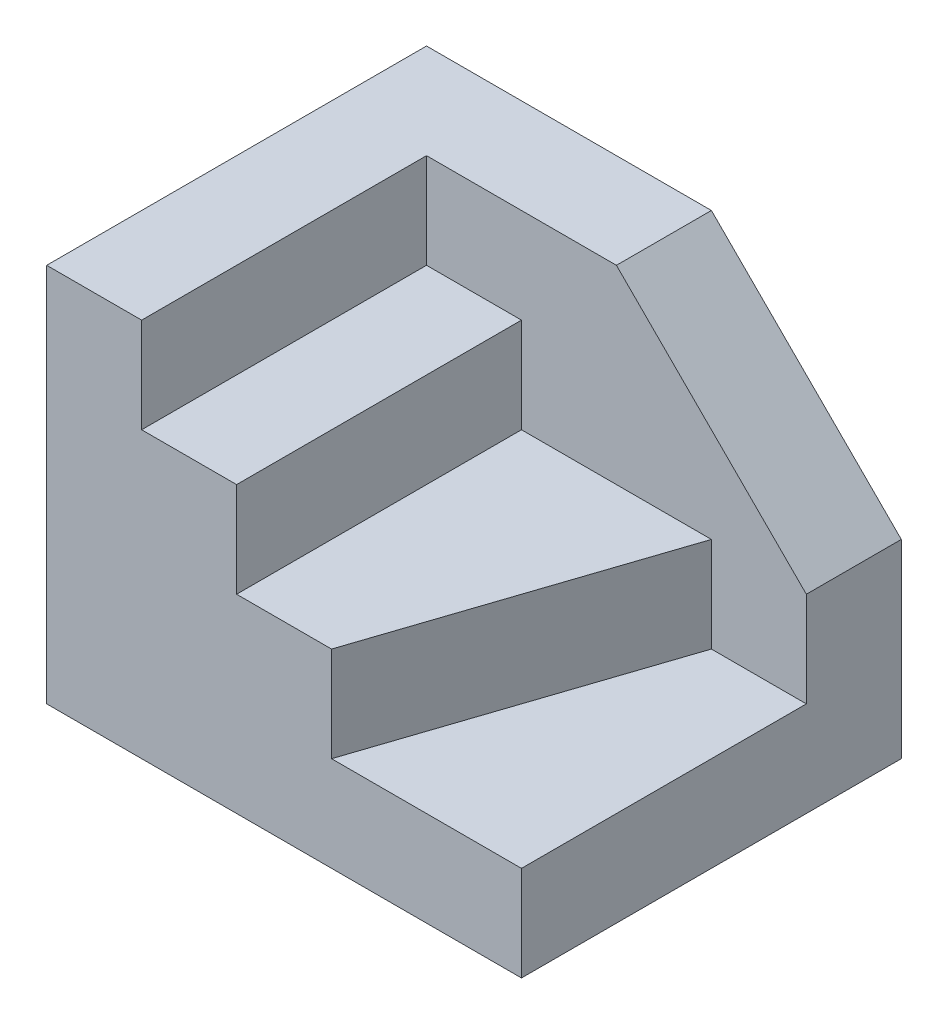
ISO-10303-21;
HEADER;
FILE_DESCRIPTION(('STEP AP214'),'2;1');
FILE_NAME('part.step','',(''),(''),'','','');
FILE_SCHEMA(('AUTOMOTIVE_DESIGN { 1 0 10303 214 1 1 1 1 }'));
ENDSEC;
DATA;
#1=APPLICATION_CONTEXT('core data for automotive mechanical design processes');
#2=APPLICATION_PROTOCOL_DEFINITION('international standard','automotive_design',2000,#1);
#3=PRODUCT_CONTEXT('',#1,'mechanical');
#4=PRODUCT('Part','Part','',(#3));
#5=PRODUCT_RELATED_PRODUCT_CATEGORY('part','',(#4));
#6=PRODUCT_DEFINITION_FORMATION('','',#4);
#7=PRODUCT_DEFINITION_CONTEXT('part definition',#1,'design');
#8=PRODUCT_DEFINITION('design','',#6,#7);
#9=PRODUCT_DEFINITION_SHAPE('','',#8);
#10=(LENGTH_UNIT() NAMED_UNIT(*) SI_UNIT(.MILLI.,.METRE.));
#11=(NAMED_UNIT(*) PLANE_ANGLE_UNIT() SI_UNIT($,.RADIAN.));
#12=(NAMED_UNIT(*) SI_UNIT($,.STERADIAN.) SOLID_ANGLE_UNIT());
#13=UNCERTAINTY_MEASURE_WITH_UNIT(LENGTH_MEASURE(1.E-05),#10,'distance_accuracy_value','');
#14=(GEOMETRIC_REPRESENTATION_CONTEXT(3) GLOBAL_UNCERTAINTY_ASSIGNED_CONTEXT((#13)) GLOBAL_UNIT_ASSIGNED_CONTEXT((#10,
#11,#12)) REPRESENTATION_CONTEXT('',''));
#15=CARTESIAN_POINT('',(0.,0.,0.));
#16=DIRECTION('',(0.,0.,1.));
#17=DIRECTION('',(1.,0.,0.));
#18=AXIS2_PLACEMENT_3D('',#15,#16,#17);
#19=CARTESIAN_POINT('',(5.,10.,-10.));
#20=DIRECTION('',(0.,-1.,0.));
#21=DIRECTION('',(1.,0.,0.));
#22=AXIS2_PLACEMENT_3D('',#19,#20,#21);
#23=PLANE('',#22);
#24=DIRECTION('',(0.316227766016838,0.,-0.948683298050514));
#25=VECTOR('',#24,1.);
#26=CARTESIAN_POINT('',(5.,10.,20.));
#27=LINE('',#26,#25);
#28=CARTESIAN_POINT('',(5.,10.,20.));
#29=VERTEX_POINT('',#28);
#30=CARTESIAN_POINT('',(15.,9.99999999999999,-10.));
#31=VERTEX_POINT('',#30);
#32=EDGE_CURVE('E128',#29,#31,#27,.T.);
#33=ORIENTED_EDGE('',*,*,#32,.F.);
#34=DIRECTION('',(1.,0.,0.));
#35=VECTOR('',#34,1.);
#36=CARTESIAN_POINT('',(5.,10.,20.));
#37=LINE('',#36,#35);
#38=CARTESIAN_POINT('',(25.,9.99999999999999,20.));
#39=VERTEX_POINT('',#38);
#40=EDGE_CURVE('E193',#29,#39,#37,.T.);
#41=ORIENTED_EDGE('',*,*,#40,.T.);
#42=DIRECTION('',(0.,0.,1.));
#43=VECTOR('',#42,1.);
#44=CARTESIAN_POINT('',(25.,9.99999999999999,-10.));
#45=LINE('',#44,#43);
#46=CARTESIAN_POINT('',(25.,9.99999999999999,-10.));
#47=VERTEX_POINT('',#46);
#48=EDGE_CURVE('E148',#47,#39,#45,.T.);
#49=ORIENTED_EDGE('',*,*,#48,.F.);
#50=DIRECTION('',(1.,0.,0.));
#51=VECTOR('',#50,1.);
#52=CARTESIAN_POINT('',(5.,10.,-10.));
#53=LINE('',#52,#51);
#54=EDGE_CURVE('E210',#31,#47,#53,.T.);
#55=ORIENTED_EDGE('',*,*,#54,.F.);
#56=EDGE_LOOP('',(#33,#41,#49,#55));
#57=FACE_BOUND('',#56,.T.);
#58=ADVANCED_FACE('F32',(#57),#23,.F.);
#59=CARTESIAN_POINT('',(0.,0.,-10.));
#60=DIRECTION('',(0.,0.,1.));
#61=DIRECTION('',(1.,0.,0.));
#62=AXIS2_PLACEMENT_3D('',#59,#60,#61);
#63=PLANE('',#62);
#64=DIRECTION('',(0.707106781186548,-0.707106781186548,0.));
#65=VECTOR('',#64,1.);
#66=CARTESIAN_POINT('',(5.,40.,-10.));
#67=LINE('',#66,#65);
#68=CARTESIAN_POINT('',(5.,40.,-10.));
#69=VERTEX_POINT('',#68);
#70=CARTESIAN_POINT('',(25.,20.,-10.));
#71=VERTEX_POINT('',#70);
#72=EDGE_CURVE('E123',#69,#71,#67,.T.);
#73=ORIENTED_EDGE('',*,*,#72,.F.);
#74=DIRECTION('',(-1.,0.,0.));
#75=VECTOR('',#74,1.);
#76=CARTESIAN_POINT('',(25.,40.,-10.));
#77=LINE('',#76,#75);
#78=CARTESIAN_POINT('',(-15.,40.,-10.));
#79=VERTEX_POINT('',#78);
#80=EDGE_CURVE('E195',#69,#79,#77,.T.);
#81=ORIENTED_EDGE('',*,*,#80,.T.);
#82=DIRECTION('',(0.,-1.,0.));
#83=VECTOR('',#82,1.);
#84=CARTESIAN_POINT('',(-15.,40.,-10.));
#85=LINE('',#84,#83);
#86=CARTESIAN_POINT('',(-15.,30.,-10.));
#87=VERTEX_POINT('',#86);
#88=EDGE_CURVE('E218',#79,#87,#85,.T.);
#89=ORIENTED_EDGE('',*,*,#88,.T.);
#90=DIRECTION('',(1.,0.,0.));
#91=VECTOR('',#90,1.);
#92=CARTESIAN_POINT('',(-15.,30.,-10.));
#93=LINE('',#92,#91);
#94=CARTESIAN_POINT('',(-5.,30.,-10.));
#95=VERTEX_POINT('',#94);
#96=EDGE_CURVE('E215',#87,#95,#93,.T.);
#97=ORIENTED_EDGE('',*,*,#96,.T.);
#98=DIRECTION('',(0.,-1.,0.));
#99=VECTOR('',#98,1.);
#100=CARTESIAN_POINT('',(-5.,30.,-10.));
#101=LINE('',#100,#99);
#102=CARTESIAN_POINT('',(-4.99999999999999,20.,-10.));
#103=VERTEX_POINT('',#102);
#104=EDGE_CURVE('E213',#95,#103,#101,.T.);
#105=ORIENTED_EDGE('',*,*,#104,.T.);
#106=DIRECTION('',(1.,0.,0.));
#107=VECTOR('',#106,1.);
#108=CARTESIAN_POINT('',(-4.99999999999999,20.,-10.));
#109=LINE('',#108,#107);
#110=CARTESIAN_POINT('',(15.,20.,-10.));
#111=VERTEX_POINT('',#110);
#112=EDGE_CURVE('E55',#103,#111,#109,.T.);
#113=ORIENTED_EDGE('',*,*,#112,.T.);
#114=DIRECTION('',(0.,-1.,0.));
#115=VECTOR('',#114,1.);
#116=CARTESIAN_POINT('',(15.,20.,-10.));
#117=LINE('',#116,#115);
#118=EDGE_CURVE('E208',#111,#31,#117,.T.);
#119=ORIENTED_EDGE('',*,*,#118,.T.);
#120=ORIENTED_EDGE('',*,*,#54,.T.);
#121=DIRECTION('',(0.,1.,0.));
#122=VECTOR('',#121,1.);
#123=CARTESIAN_POINT('',(25.,9.99999999999999,-10.));
#124=LINE('',#123,#122);
#125=EDGE_CURVE('E188',#47,#71,#124,.T.);
#126=ORIENTED_EDGE('',*,*,#125,.T.);
#127=EDGE_LOOP('',(#73,#81,#89,#97,#105,#113,#119,#120,#126));
#128=FACE_BOUND('',#127,.T.);
#129=ADVANCED_FACE('F229',(#128),#63,.T.);
#130=CARTESIAN_POINT('',(25.,40.,20.));
#131=DIRECTION('',(-1.,0.,0.));
#132=DIRECTION('',(0.,0.,1.));
#133=AXIS2_PLACEMENT_3D('',#130,#131,#132);
#134=PLANE('',#133);
#135=DIRECTION('',(0.,-1.,0.));
#136=VECTOR('',#135,1.);
#137=CARTESIAN_POINT('',(25.,40.,-20.));
#138=LINE('',#137,#136);
#139=CARTESIAN_POINT('',(25.,20.,-20.));
#140=VERTEX_POINT('',#139);
#141=CARTESIAN_POINT('',(25.,0.,-20.));
#142=VERTEX_POINT('',#141);
#143=EDGE_CURVE('E11',#140,#142,#138,.T.);
#144=ORIENTED_EDGE('',*,*,#143,.F.);
#145=DIRECTION('',(0.,0.,1.));
#146=VECTOR('',#145,1.);
#147=CARTESIAN_POINT('',(25.,20.,-20.));
#148=LINE('',#147,#146);
#149=EDGE_CURVE('E120',#140,#71,#148,.T.);
#150=ORIENTED_EDGE('',*,*,#149,.T.);
#151=ORIENTED_EDGE('',*,*,#125,.F.);
#152=ORIENTED_EDGE('',*,*,#48,.T.);
#153=DIRECTION('',(0.,-1.,0.));
#154=VECTOR('',#153,1.);
#155=CARTESIAN_POINT('',(25.,40.,20.));
#156=LINE('',#155,#154);
#157=CARTESIAN_POINT('',(25.,0.,20.));
#158=VERTEX_POINT('',#157);
#159=EDGE_CURVE('E143',#39,#158,#156,.T.);
#160=ORIENTED_EDGE('',*,*,#159,.T.);
#161=DIRECTION('',(0.,0.,-1.));
#162=VECTOR('',#161,1.);
#163=CARTESIAN_POINT('',(25.,0.,20.));
#164=LINE('',#163,#162);
#165=EDGE_CURVE('E140',#158,#142,#164,.T.);
#166=ORIENTED_EDGE('',*,*,#165,.T.);
#167=EDGE_LOOP('',(#144,#150,#151,#152,#160,#166));
#168=FACE_BOUND('',#167,.T.);
#169=ADVANCED_FACE('F34',(#168),#134,.F.);
#170=CARTESIAN_POINT('',(-25.,40.,-20.));
#171=DIRECTION('',(0.,0.,1.));
#172=DIRECTION('',(1.,0.,0.));
#173=AXIS2_PLACEMENT_3D('',#170,#171,#172);
#174=PLANE('',#173);
#175=DIRECTION('',(-1.,0.,0.));
#176=VECTOR('',#175,1.);
#177=CARTESIAN_POINT('',(-25.,40.,-20.));
#178=LINE('',#177,#176);
#179=CARTESIAN_POINT('',(4.99999999999999,40.,-20.));
#180=VERTEX_POINT('',#179);
#181=CARTESIAN_POINT('',(-25.,40.,-20.));
#182=VERTEX_POINT('',#181);
#183=EDGE_CURVE('E136',#180,#182,#178,.T.);
#184=ORIENTED_EDGE('',*,*,#183,.F.);
#185=DIRECTION('',(0.707106781186548,-0.707106781186548,0.));
#186=VECTOR('',#185,1.);
#187=CARTESIAN_POINT('',(5.,40.,-20.));
#188=LINE('',#187,#186);
#189=EDGE_CURVE('E47',#180,#140,#188,.T.);
#190=ORIENTED_EDGE('',*,*,#189,.T.);
#191=ORIENTED_EDGE('',*,*,#143,.T.);
#192=DIRECTION('',(-1.,0.,0.));
#193=VECTOR('',#192,1.);
#194=CARTESIAN_POINT('',(-25.,0.,-20.));
#195=LINE('',#194,#193);
#196=CARTESIAN_POINT('',(-25.,0.,-20.));
#197=VERTEX_POINT('',#196);
#198=EDGE_CURVE('E147',#142,#197,#195,.T.);
#199=ORIENTED_EDGE('',*,*,#198,.T.);
#200=DIRECTION('',(0.,-1.,0.));
#201=VECTOR('',#200,1.);
#202=CARTESIAN_POINT('',(-25.,40.,-20.));
#203=LINE('',#202,#201);
#204=EDGE_CURVE('E40',#182,#197,#203,.T.);
#205=ORIENTED_EDGE('',*,*,#204,.F.);
#206=EDGE_LOOP('',(#184,#190,#191,#199,#205));
#207=FACE_BOUND('',#206,.T.);
#208=ADVANCED_FACE('F133',(#207),#174,.F.);
#209=CARTESIAN_POINT('',(-25.,40.,20.));
#210=DIRECTION('',(1.,0.,0.));
#211=DIRECTION('',(0.,0.,-1.));
#212=AXIS2_PLACEMENT_3D('',#209,#210,#211);
#213=PLANE('',#212);
#214=DIRECTION('',(0.,0.,1.));
#215=VECTOR('',#214,1.);
#216=CARTESIAN_POINT('',(-25.,0.,20.));
#217=LINE('',#216,#215);
#218=CARTESIAN_POINT('',(-25.,0.,20.));
#219=VERTEX_POINT('',#218);
#220=EDGE_CURVE('E150',#197,#219,#217,.T.);
#221=ORIENTED_EDGE('',*,*,#220,.T.);
#222=DIRECTION('',(0.,-1.,0.));
#223=VECTOR('',#222,1.);
#224=CARTESIAN_POINT('',(-25.,40.,20.));
#225=LINE('',#224,#223);
#226=CARTESIAN_POINT('',(-25.,40.,20.));
#227=VERTEX_POINT('',#226);
#228=EDGE_CURVE('E162',#227,#219,#225,.T.);
#229=ORIENTED_EDGE('',*,*,#228,.F.);
#230=DIRECTION('',(0.,0.,1.));
#231=VECTOR('',#230,1.);
#232=CARTESIAN_POINT('',(-25.,40.,20.));
#233=LINE('',#232,#231);
#234=EDGE_CURVE('E170',#182,#227,#233,.T.);
#235=ORIENTED_EDGE('',*,*,#234,.F.);
#236=ORIENTED_EDGE('',*,*,#204,.T.);
#237=EDGE_LOOP('',(#221,#229,#235,#236));
#238=FACE_BOUND('',#237,.T.);
#239=ADVANCED_FACE('F168',(#238),#213,.F.);
#240=CARTESIAN_POINT('',(-25.,40.,20.));
#241=DIRECTION('',(0.,0.,-1.));
#242=DIRECTION('',(-1.,0.,0.));
#243=AXIS2_PLACEMENT_3D('',#240,#241,#242);
#244=PLANE('',#243);
#245=ORIENTED_EDGE('',*,*,#159,.F.);
#246=ORIENTED_EDGE('',*,*,#40,.F.);
#247=DIRECTION('',(0.,-1.,0.));
#248=VECTOR('',#247,1.);
#249=CARTESIAN_POINT('',(5.,20.,20.));
#250=LINE('',#249,#248);
#251=CARTESIAN_POINT('',(5.,20.,20.));
#252=VERTEX_POINT('',#251);
#253=EDGE_CURVE('E196',#252,#29,#250,.T.);
#254=ORIENTED_EDGE('',*,*,#253,.F.);
#255=DIRECTION('',(1.,0.,0.));
#256=VECTOR('',#255,1.);
#257=CARTESIAN_POINT('',(-4.99999999999999,20.,20.));
#258=LINE('',#257,#256);
#259=CARTESIAN_POINT('',(-4.99999999999999,20.,20.));
#260=VERTEX_POINT('',#259);
#261=EDGE_CURVE('E198',#260,#252,#258,.T.);
#262=ORIENTED_EDGE('',*,*,#261,.F.);
#263=DIRECTION('',(0.,-1.,0.));
#264=VECTOR('',#263,1.);
#265=CARTESIAN_POINT('',(-5.,30.,20.));
#266=LINE('',#265,#264);
#267=CARTESIAN_POINT('',(-5.,30.,20.));
#268=VERTEX_POINT('',#267);
#269=EDGE_CURVE('E201',#268,#260,#266,.T.);
#270=ORIENTED_EDGE('',*,*,#269,.F.);
#271=DIRECTION('',(1.,0.,0.));
#272=VECTOR('',#271,1.);
#273=CARTESIAN_POINT('',(-15.,30.,20.));
#274=LINE('',#273,#272);
#275=CARTESIAN_POINT('',(-15.,30.,20.));
#276=VERTEX_POINT('',#275);
#277=EDGE_CURVE('E204',#276,#268,#274,.T.);
#278=ORIENTED_EDGE('',*,*,#277,.F.);
#279=DIRECTION('',(0.,-1.,0.));
#280=VECTOR('',#279,1.);
#281=CARTESIAN_POINT('',(-15.,40.,20.));
#282=LINE('',#281,#280);
#283=CARTESIAN_POINT('',(-15.,40.,20.));
#284=VERTEX_POINT('',#283);
#285=EDGE_CURVE('E180',#284,#276,#282,.T.);
#286=ORIENTED_EDGE('',*,*,#285,.F.);
#287=DIRECTION('',(1.,0.,0.));
#288=VECTOR('',#287,1.);
#289=CARTESIAN_POINT('',(-25.,40.,20.));
#290=LINE('',#289,#288);
#291=EDGE_CURVE('E155',#227,#284,#290,.T.);
#292=ORIENTED_EDGE('',*,*,#291,.F.);
#293=ORIENTED_EDGE('',*,*,#228,.T.);
#294=DIRECTION('',(1.,0.,0.));
#295=VECTOR('',#294,1.);
#296=CARTESIAN_POINT('',(-25.,0.,20.));
#297=LINE('',#296,#295);
#298=EDGE_CURVE('E159',#219,#158,#297,.T.);
#299=ORIENTED_EDGE('',*,*,#298,.T.);
#300=EDGE_LOOP('',(#245,#246,#254,#262,#270,#278,#286,#292,#293,#299));
#301=FACE_BOUND('',#300,.T.);
#302=ADVANCED_FACE('F173',(#301),#244,.F.);
#303=CARTESIAN_POINT('',(0.,40.,0.));
#304=DIRECTION('',(0.,-1.,0.));
#305=DIRECTION('',(0.,0.,-1.));
#306=AXIS2_PLACEMENT_3D('',#303,#304,#305);
#307=PLANE('',#306);
#308=ORIENTED_EDGE('',*,*,#80,.F.);
#309=DIRECTION('',(0.,0.,1.));
#310=VECTOR('',#309,1.);
#311=CARTESIAN_POINT('',(5.,40.,-20.));
#312=LINE('',#311,#310);
#313=EDGE_CURVE('E129',#180,#69,#312,.T.);
#314=ORIENTED_EDGE('',*,*,#313,.F.);
#315=ORIENTED_EDGE('',*,*,#183,.T.);
#316=ORIENTED_EDGE('',*,*,#234,.T.);
#317=ORIENTED_EDGE('',*,*,#291,.T.);
#318=DIRECTION('',(0.,0.,1.));
#319=VECTOR('',#318,1.);
#320=CARTESIAN_POINT('',(-15.,40.,-10.));
#321=LINE('',#320,#319);
#322=EDGE_CURVE('E185',#79,#284,#321,.T.);
#323=ORIENTED_EDGE('',*,*,#322,.F.);
#324=EDGE_LOOP('',(#308,#314,#315,#316,#317,#323));
#325=FACE_BOUND('',#324,.T.);
#326=ADVANCED_FACE('F231',(#325),#307,.F.);
#327=CARTESIAN_POINT('',(0.,0.,0.));
#328=DIRECTION('',(0.,-1.,0.));
#329=DIRECTION('',(0.,0.,-1.));
#330=AXIS2_PLACEMENT_3D('',#327,#328,#329);
#331=PLANE('',#330);
#332=ORIENTED_EDGE('',*,*,#165,.F.);
#333=ORIENTED_EDGE('',*,*,#298,.F.);
#334=ORIENTED_EDGE('',*,*,#220,.F.);
#335=ORIENTED_EDGE('',*,*,#198,.F.);
#336=EDGE_LOOP('',(#332,#333,#334,#335));
#337=FACE_BOUND('',#336,.T.);
#338=ADVANCED_FACE('F171',(#337),#331,.T.);
#339=CARTESIAN_POINT('',(-4.99999999999999,20.,-10.));
#340=DIRECTION('',(0.,-1.,0.));
#341=DIRECTION('',(0.,0.,-1.));
#342=AXIS2_PLACEMENT_3D('',#339,#340,#341);
#343=PLANE('',#342);
#344=ORIENTED_EDGE('',*,*,#261,.T.);
#345=DIRECTION('',(0.316227766016838,0.,-0.948683298050514));
#346=VECTOR('',#345,1.);
#347=CARTESIAN_POINT('',(5.,20.,20.));
#348=LINE('',#347,#346);
#349=EDGE_CURVE('E223',#252,#111,#348,.T.);
#350=ORIENTED_EDGE('',*,*,#349,.T.);
#351=ORIENTED_EDGE('',*,*,#112,.F.);
#352=DIRECTION('',(0.,0.,1.));
#353=VECTOR('',#352,1.);
#354=CARTESIAN_POINT('',(-4.99999999999999,20.,-10.));
#355=LINE('',#354,#353);
#356=EDGE_CURVE('E152',#103,#260,#355,.T.);
#357=ORIENTED_EDGE('',*,*,#356,.T.);
#358=EDGE_LOOP('',(#344,#350,#351,#357));
#359=FACE_BOUND('',#358,.T.);
#360=ADVANCED_FACE('F243',(#359),#343,.F.);
#361=CARTESIAN_POINT('',(-5.,30.,-10.));
#362=DIRECTION('',(-1.,0.,0.));
#363=DIRECTION('',(0.,-1.,0.));
#364=AXIS2_PLACEMENT_3D('',#361,#362,#363);
#365=PLANE('',#364);
#366=ORIENTED_EDGE('',*,*,#269,.T.);
#367=ORIENTED_EDGE('',*,*,#356,.F.);
#368=ORIENTED_EDGE('',*,*,#104,.F.);
#369=DIRECTION('',(0.,0.,1.));
#370=VECTOR('',#369,1.);
#371=CARTESIAN_POINT('',(-5.,30.,-10.));
#372=LINE('',#371,#370);
#373=EDGE_CURVE('E190',#95,#268,#372,.T.);
#374=ORIENTED_EDGE('',*,*,#373,.T.);
#375=EDGE_LOOP('',(#366,#367,#368,#374));
#376=FACE_BOUND('',#375,.T.);
#377=ADVANCED_FACE('F240',(#376),#365,.F.);
#378=CARTESIAN_POINT('',(-15.,30.,-10.));
#379=DIRECTION('',(0.,-1.,0.));
#380=DIRECTION('',(0.,0.,-1.));
#381=AXIS2_PLACEMENT_3D('',#378,#379,#380);
#382=PLANE('',#381);
#383=ORIENTED_EDGE('',*,*,#277,.T.);
#384=ORIENTED_EDGE('',*,*,#373,.F.);
#385=ORIENTED_EDGE('',*,*,#96,.F.);
#386=DIRECTION('',(0.,0.,1.));
#387=VECTOR('',#386,1.);
#388=CARTESIAN_POINT('',(-15.,30.,-10.));
#389=LINE('',#388,#387);
#390=EDGE_CURVE('E187',#87,#276,#389,.T.);
#391=ORIENTED_EDGE('',*,*,#390,.T.);
#392=EDGE_LOOP('',(#383,#384,#385,#391));
#393=FACE_BOUND('',#392,.T.);
#394=ADVANCED_FACE('F237',(#393),#382,.F.);
#395=CARTESIAN_POINT('',(-15.,40.,-10.));
#396=DIRECTION('',(-1.,0.,0.));
#397=DIRECTION('',(0.,-1.,0.));
#398=AXIS2_PLACEMENT_3D('',#395,#396,#397);
#399=PLANE('',#398);
#400=ORIENTED_EDGE('',*,*,#285,.T.);
#401=ORIENTED_EDGE('',*,*,#390,.F.);
#402=ORIENTED_EDGE('',*,*,#88,.F.);
#403=ORIENTED_EDGE('',*,*,#322,.T.);
#404=EDGE_LOOP('',(#400,#401,#402,#403));
#405=FACE_BOUND('',#404,.T.);
#406=ADVANCED_FACE('F233',(#405),#399,.F.);
#407=CARTESIAN_POINT('',(5.,20.,20.));
#408=DIRECTION('',(-0.948683298050514,0.,-0.316227766016838));
#409=DIRECTION('',(-0.316227766016838,0.,0.948683298050514));
#410=AXIS2_PLACEMENT_3D('',#407,#408,#409);
#411=PLANE('',#410);
#412=ORIENTED_EDGE('',*,*,#32,.T.);
#413=ORIENTED_EDGE('',*,*,#118,.F.);
#414=ORIENTED_EDGE('',*,*,#349,.F.);
#415=ORIENTED_EDGE('',*,*,#253,.T.);
#416=EDGE_LOOP('',(#412,#413,#414,#415));
#417=FACE_BOUND('',#416,.T.);
#418=ADVANCED_FACE('F246',(#417),#411,.F.);
#419=CARTESIAN_POINT('',(5.,40.,-20.));
#420=DIRECTION('',(-0.707106781186548,-0.707106781186548,0.));
#421=DIRECTION('',(0.707106781186548,-0.707106781186548,0.));
#422=AXIS2_PLACEMENT_3D('',#419,#420,#421);
#423=PLANE('',#422);
#424=ORIENTED_EDGE('',*,*,#72,.T.);
#425=ORIENTED_EDGE('',*,*,#149,.F.);
#426=ORIENTED_EDGE('',*,*,#189,.F.);
#427=ORIENTED_EDGE('',*,*,#313,.T.);
#428=EDGE_LOOP('',(#424,#425,#426,#427));
#429=FACE_BOUND('',#428,.T.);
#430=ADVANCED_FACE('F121',(#429),#423,.F.);
#431=CLOSED_SHELL('',(#58,#129,#169,#208,#239,#302,#326,#338,#360,#377,#394,#406,#418,#430));
#432=MANIFOLD_SOLID_BREP('B2',#431);
#433=ADVANCED_BREP_SHAPE_REPRESENTATION('',(#18,#432),#14);
#434=SHAPE_DEFINITION_REPRESENTATION(#9,#433);
ENDSEC;
END-ISO-10303-21;
